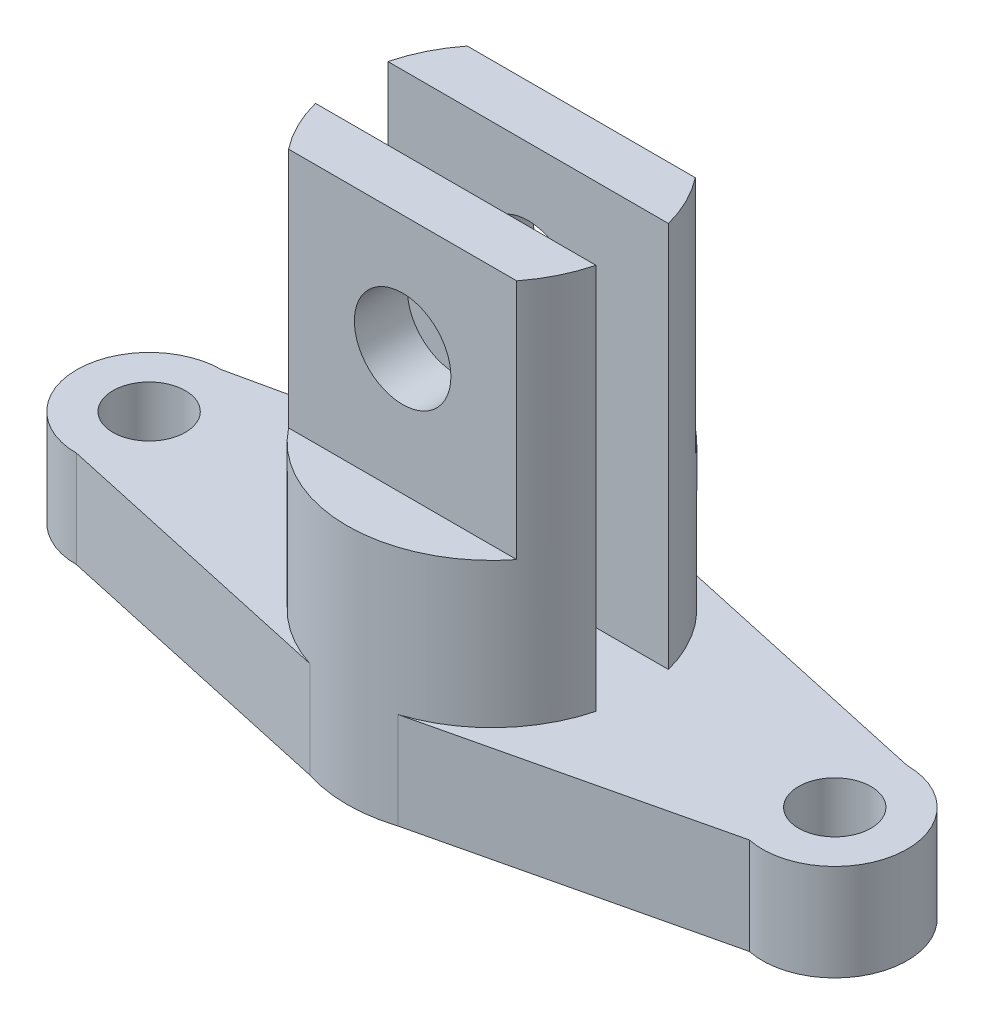
ISO-10303-21;
HEADER;
FILE_DESCRIPTION(('STEP AP214'),'2;1');
FILE_NAME('part.step','',(''),(''),'','','');
FILE_SCHEMA(('AUTOMOTIVE_DESIGN { 1 0 10303 214 1 1 1 1 }'));
ENDSEC;
DATA;
#1=APPLICATION_CONTEXT('core data for automotive mechanical design processes');
#2=APPLICATION_PROTOCOL_DEFINITION('international standard','automotive_design',2000,#1);
#3=PRODUCT_CONTEXT('',#1,'mechanical');
#4=PRODUCT('Part','Part','',(#3));
#5=PRODUCT_RELATED_PRODUCT_CATEGORY('part','',(#4));
#6=PRODUCT_DEFINITION_FORMATION('','',#4);
#7=PRODUCT_DEFINITION_CONTEXT('part definition',#1,'design');
#8=PRODUCT_DEFINITION('design','',#6,#7);
#9=PRODUCT_DEFINITION_SHAPE('','',#8);
#10=(LENGTH_UNIT() NAMED_UNIT(*) SI_UNIT(.MILLI.,.METRE.));
#11=(NAMED_UNIT(*) PLANE_ANGLE_UNIT() SI_UNIT($,.RADIAN.));
#12=(NAMED_UNIT(*) SI_UNIT($,.STERADIAN.) SOLID_ANGLE_UNIT());
#13=UNCERTAINTY_MEASURE_WITH_UNIT(LENGTH_MEASURE(1.E-05),#10,'distance_accuracy_value','');
#14=(GEOMETRIC_REPRESENTATION_CONTEXT(3) GLOBAL_UNCERTAINTY_ASSIGNED_CONTEXT((#13)) GLOBAL_UNIT_ASSIGNED_CONTEXT((#10,
#11,#12)) REPRESENTATION_CONTEXT('',''));
#15=CARTESIAN_POINT('',(0.,0.,0.));
#16=DIRECTION('',(0.,0.,1.));
#17=DIRECTION('',(1.,0.,0.));
#18=AXIS2_PLACEMENT_3D('',#15,#16,#17);
#19=CARTESIAN_POINT('',(21.1399812312886,20.,8.43496558117299));
#20=DIRECTION('',(0.,-1.,0.));
#21=DIRECTION('',(0.,0.,-1.));
#22=AXIS2_PLACEMENT_3D('',#19,#20,#21);
#23=CYLINDRICAL_SURFACE('',#22,30.);
#24=DIRECTION('',(0.,1.,0.));
#25=VECTOR('',#24,1.);
#26=CARTESIAN_POINT('',(-2.47675012595048,50.,26.934965581173));
#27=LINE('',#26,#25);
#28=CARTESIAN_POINT('',(-2.47675012595048,50.,26.934965581173));
#29=VERTEX_POINT('',#28);
#30=CARTESIAN_POINT('',(-2.47675012595048,100.,26.934965581173));
#31=VERTEX_POINT('',#30);
#32=EDGE_CURVE('E171',#29,#31,#27,.T.);
#33=ORIENTED_EDGE('',*,*,#32,.T.);
#34=CARTESIAN_POINT('',(21.1399812312886,100.,8.43496558117299));
#35=DIRECTION('',(0.,1.,0.));
#36=DIRECTION('',(0.,0.,1.));
#37=AXIS2_PLACEMENT_3D('',#34,#35,#36);
#38=CIRCLE('',#37,30.);
#39=CARTESIAN_POINT('',(-7.90739386526701,100.,15.934965581173));
#40=VERTEX_POINT('',#39);
#41=EDGE_CURVE('E181',#40,#31,#38,.T.);
#42=ORIENTED_EDGE('',*,*,#41,.F.);
#43=DIRECTION('',(0.,-1.,0.));
#44=VECTOR('',#43,1.);
#45=CARTESIAN_POINT('',(-7.90739386526701,100.,15.934965581173));
#46=LINE('',#45,#44);
#47=CARTESIAN_POINT('',(-7.90739386526701,20.,15.934965581173));
#48=VERTEX_POINT('',#47);
#49=EDGE_CURVE('E186',#40,#48,#46,.T.);
#50=ORIENTED_EDGE('',*,*,#49,.T.);
#51=CARTESIAN_POINT('',(21.1399812312886,20.,8.43496558117299));
#52=DIRECTION('',(0.,1.,0.));
#53=DIRECTION('',(0.,0.,1.));
#54=AXIS2_PLACEMENT_3D('',#51,#52,#53);
#55=CIRCLE('',#54,30.);
#56=CARTESIAN_POINT('',(11.9859811975325,20.,37.0042547459736));
#57=VERTEX_POINT('',#56);
#58=EDGE_CURVE('E192',#57,#48,#55,.F.);
#59=ORIENTED_EDGE('',*,*,#58,.F.);
#60=DIRECTION('',(0.,-1.,0.));
#61=VECTOR('',#60,1.);
#62=CARTESIAN_POINT('',(11.9859811975326,20.,37.0042547459736));
#63=LINE('',#62,#61);
#64=CARTESIAN_POINT('',(11.9859811975326,0.,37.0042547459736));
#65=VERTEX_POINT('',#64);
#66=EDGE_CURVE('E242',#57,#65,#63,.T.);
#67=ORIENTED_EDGE('',*,*,#66,.T.);
#68=CARTESIAN_POINT('',(21.1399812312886,0.,8.43496558117299));
#69=DIRECTION('',(0.,1.,0.));
#70=DIRECTION('',(0.,0.,1.));
#71=AXIS2_PLACEMENT_3D('',#68,#69,#70);
#72=CIRCLE('',#71,30.);
#73=CARTESIAN_POINT('',(30.2939812650446,0.,37.0042547459736));
#74=VERTEX_POINT('',#73);
#75=EDGE_CURVE('E224',#65,#74,#72,.T.);
#76=ORIENTED_EDGE('',*,*,#75,.T.);
#77=DIRECTION('',(0.,-1.,0.));
#78=VECTOR('',#77,1.);
#79=CARTESIAN_POINT('',(30.2939812650446,20.,37.0042547459736));
#80=LINE('',#79,#78);
#81=CARTESIAN_POINT('',(30.2939812650446,20.,37.0042547459736));
#82=VERTEX_POINT('',#81);
#83=EDGE_CURVE('E11',#82,#74,#80,.T.);
#84=ORIENTED_EDGE('',*,*,#83,.F.);
#85=CARTESIAN_POINT('',(50.1873563278442,20.,15.934965581173));
#86=VERTEX_POINT('',#85);
#87=EDGE_CURVE('E191',#86,#82,#55,.F.);
#88=ORIENTED_EDGE('',*,*,#87,.F.);
#89=DIRECTION('',(0.,-1.,0.));
#90=VECTOR('',#89,1.);
#91=CARTESIAN_POINT('',(50.1873563278442,100.,15.934965581173));
#92=LINE('',#91,#90);
#93=CARTESIAN_POINT('',(50.1873563278442,100.,15.934965581173));
#94=VERTEX_POINT('',#93);
#95=EDGE_CURVE('E189',#94,#86,#92,.T.);
#96=ORIENTED_EDGE('',*,*,#95,.F.);
#97=CARTESIAN_POINT('',(44.7567125885277,100.,26.934965581173));
#98=VERTEX_POINT('',#97);
#99=EDGE_CURVE('E165',#98,#94,#38,.T.);
#100=ORIENTED_EDGE('',*,*,#99,.F.);
#101=DIRECTION('',(0.,1.,0.));
#102=VECTOR('',#101,1.);
#103=CARTESIAN_POINT('',(44.7567125885277,50.,26.934965581173));
#104=LINE('',#103,#102);
#105=CARTESIAN_POINT('',(44.7567125885277,50.,26.934965581173));
#106=VERTEX_POINT('',#105);
#107=EDGE_CURVE('E59',#106,#98,#104,.T.);
#108=ORIENTED_EDGE('',*,*,#107,.F.);
#109=CARTESIAN_POINT('',(21.1399812312886,50.,8.43496558117299));
#110=DIRECTION('',(0.,1.,0.));
#111=DIRECTION('',(0.,0.,1.));
#112=AXIS2_PLACEMENT_3D('',#109,#110,#111);
#113=CIRCLE('',#112,30.);
#114=EDGE_CURVE('E177',#29,#106,#113,.T.);
#115=ORIENTED_EDGE('',*,*,#114,.F.);
#116=EDGE_LOOP('',(#33,#42,#50,#59,#67,#76,#84,#88,#96,#100,#108,#115));
#117=FACE_BOUND('',#116,.T.);
#118=ADVANCED_FACE('F36',(#117),#23,.T.);
#119=CARTESIAN_POINT('',(21.1399812312886,20.,8.43496558117299));
#120=DIRECTION('',(0.,-1.,0.));
#121=DIRECTION('',(0.,0.,-1.));
#122=AXIS2_PLACEMENT_3D('',#119,#120,#121);
#123=CYLINDRICAL_SURFACE('',#122,30.);
#124=DIRECTION('',(0.,1.,0.));
#125=VECTOR('',#124,1.);
#126=CARTESIAN_POINT('',(44.7567125885277,50.,-10.065034418827));
#127=LINE('',#126,#125);
#128=CARTESIAN_POINT('',(44.7567125885277,50.,-10.065034418827));
#129=VERTEX_POINT('',#128);
#130=CARTESIAN_POINT('',(44.7567125885277,100.,-10.065034418827));
#131=VERTEX_POINT('',#130);
#132=EDGE_CURVE('E151',#129,#131,#127,.T.);
#133=ORIENTED_EDGE('',*,*,#132,.T.);
#134=CARTESIAN_POINT('',(21.1399812312886,100.,8.43496558117299));
#135=DIRECTION('',(0.,1.,0.));
#136=DIRECTION('',(0.,0.,1.));
#137=AXIS2_PLACEMENT_3D('',#134,#135,#136);
#138=CIRCLE('',#137,30.);
#139=CARTESIAN_POINT('',(50.1873563278442,100.,0.934965581172988));
#140=VERTEX_POINT('',#139);
#141=EDGE_CURVE('E198',#140,#131,#138,.T.);
#142=ORIENTED_EDGE('',*,*,#141,.F.);
#143=DIRECTION('',(0.,-1.,0.));
#144=VECTOR('',#143,1.);
#145=CARTESIAN_POINT('',(50.1873563278442,100.,0.934965581172988));
#146=LINE('',#145,#144);
#147=CARTESIAN_POINT('',(50.1873563278442,20.,0.934965581172988));
#148=VERTEX_POINT('',#147);
#149=EDGE_CURVE('E203',#140,#148,#146,.T.);
#150=ORIENTED_EDGE('',*,*,#149,.T.);
#151=CARTESIAN_POINT('',(21.1399812312886,20.,8.43496558117299));
#152=DIRECTION('',(0.,1.,0.));
#153=DIRECTION('',(0.,0.,1.));
#154=AXIS2_PLACEMENT_3D('',#151,#152,#153);
#155=CIRCLE('',#154,30.);
#156=CARTESIAN_POINT('',(30.2939812650446,20.,-20.1343235836277));
#157=VERTEX_POINT('',#156);
#158=EDGE_CURVE('E208',#157,#148,#155,.F.);
#159=ORIENTED_EDGE('',*,*,#158,.F.);
#160=DIRECTION('',(0.,-1.,0.));
#161=VECTOR('',#160,1.);
#162=CARTESIAN_POINT('',(30.2939812650446,20.,-20.1343235836277));
#163=LINE('',#162,#161);
#164=CARTESIAN_POINT('',(30.2939812650446,0.,-20.1343235836277));
#165=VERTEX_POINT('',#164);
#166=EDGE_CURVE('E269',#157,#165,#163,.T.);
#167=ORIENTED_EDGE('',*,*,#166,.T.);
#168=CARTESIAN_POINT('',(21.1399812312886,0.,8.43496558117299));
#169=DIRECTION('',(0.,1.,0.));
#170=DIRECTION('',(0.,0.,1.));
#171=AXIS2_PLACEMENT_3D('',#168,#169,#170);
#172=CIRCLE('',#171,30.);
#173=CARTESIAN_POINT('',(11.9859811975326,0.,-20.1343235836276));
#174=VERTEX_POINT('',#173);
#175=EDGE_CURVE('E251',#165,#174,#172,.T.);
#176=ORIENTED_EDGE('',*,*,#175,.T.);
#177=DIRECTION('',(0.,-1.,0.));
#178=VECTOR('',#177,1.);
#179=CARTESIAN_POINT('',(11.9859811975326,20.,-20.1343235836276));
#180=LINE('',#179,#178);
#181=CARTESIAN_POINT('',(11.9859811975325,20.,-20.1343235836276));
#182=VERTEX_POINT('',#181);
#183=EDGE_CURVE('E266',#182,#174,#180,.T.);
#184=ORIENTED_EDGE('',*,*,#183,.F.);
#185=CARTESIAN_POINT('',(-7.90739386526701,20.,0.934965581172988));
#186=VERTEX_POINT('',#185);
#187=EDGE_CURVE('E209',#186,#182,#155,.F.);
#188=ORIENTED_EDGE('',*,*,#187,.F.);
#189=DIRECTION('',(0.,-1.,0.));
#190=VECTOR('',#189,1.);
#191=CARTESIAN_POINT('',(-7.90739386526701,100.,0.934965581172988));
#192=LINE('',#191,#190);
#193=CARTESIAN_POINT('',(-7.90739386526701,100.,0.934965581172988));
#194=VERTEX_POINT('',#193);
#195=EDGE_CURVE('E206',#194,#186,#192,.T.);
#196=ORIENTED_EDGE('',*,*,#195,.F.);
#197=CARTESIAN_POINT('',(-2.47675012595048,100.,-10.065034418827));
#198=VERTEX_POINT('',#197);
#199=EDGE_CURVE('E163',#198,#194,#138,.T.);
#200=ORIENTED_EDGE('',*,*,#199,.F.);
#201=DIRECTION('',(0.,1.,0.));
#202=VECTOR('',#201,1.);
#203=CARTESIAN_POINT('',(-2.47675012595048,50.,-10.065034418827));
#204=LINE('',#203,#202);
#205=CARTESIAN_POINT('',(-2.47675012595048,50.,-10.065034418827));
#206=VERTEX_POINT('',#205);
#207=EDGE_CURVE('E51',#206,#198,#204,.T.);
#208=ORIENTED_EDGE('',*,*,#207,.F.);
#209=CARTESIAN_POINT('',(21.1399812312886,50.,8.43496558117299));
#210=DIRECTION('',(0.,1.,0.));
#211=DIRECTION('',(0.,0.,1.));
#212=AXIS2_PLACEMENT_3D('',#209,#210,#211);
#213=CIRCLE('',#212,30.);
#214=EDGE_CURVE('E154',#129,#206,#213,.T.);
#215=ORIENTED_EDGE('',*,*,#214,.F.);
#216=EDGE_LOOP('',(#133,#142,#150,#159,#167,#176,#184,#188,#196,#200,#208,#215));
#217=FACE_BOUND('',#216,.T.);
#218=ADVANCED_FACE('F161',(#217),#123,.T.);
#219=CARTESIAN_POINT('',(21.1399812312886,100.,8.43496558117299));
#220=DIRECTION('',(0.,1.,0.));
#221=DIRECTION('',(0.,0.,1.));
#222=AXIS2_PLACEMENT_3D('',#219,#220,#221);
#223=PLANE('',#222);
#224=ORIENTED_EDGE('',*,*,#141,.T.);
#225=DIRECTION('',(-1.,0.,0.));
#226=VECTOR('',#225,1.);
#227=CARTESIAN_POINT('',(44.7567125885277,100.,-10.065034418827));
#228=LINE('',#227,#226);
#229=EDGE_CURVE('E158',#131,#198,#228,.T.);
#230=ORIENTED_EDGE('',*,*,#229,.T.);
#231=ORIENTED_EDGE('',*,*,#199,.T.);
#232=DIRECTION('',(1.,0.,0.));
#233=VECTOR('',#232,1.);
#234=CARTESIAN_POINT('',(-7.90739386526701,100.,0.934965581172988));
#235=LINE('',#234,#233);
#236=EDGE_CURVE('E201',#194,#140,#235,.T.);
#237=ORIENTED_EDGE('',*,*,#236,.T.);
#238=EDGE_LOOP('',(#224,#230,#231,#237));
#239=FACE_BOUND('',#238,.T.);
#240=ADVANCED_FACE('F325',(#239),#223,.T.);
#241=CARTESIAN_POINT('',(21.1399812312886,100.,8.43496558117299));
#242=DIRECTION('',(0.,1.,0.));
#243=DIRECTION('',(0.,0.,1.));
#244=AXIS2_PLACEMENT_3D('',#241,#242,#243);
#245=PLANE('',#244);
#246=ORIENTED_EDGE('',*,*,#41,.T.);
#247=DIRECTION('',(1.,0.,0.));
#248=VECTOR('',#247,1.);
#249=CARTESIAN_POINT('',(-2.47675012595048,100.,26.934965581173));
#250=LINE('',#249,#248);
#251=EDGE_CURVE('E175',#31,#98,#250,.T.);
#252=ORIENTED_EDGE('',*,*,#251,.T.);
#253=ORIENTED_EDGE('',*,*,#99,.T.);
#254=DIRECTION('',(-1.,0.,0.));
#255=VECTOR('',#254,1.);
#256=CARTESIAN_POINT('',(50.1873563278442,100.,15.934965581173));
#257=LINE('',#256,#255);
#258=EDGE_CURVE('E184',#94,#40,#257,.T.);
#259=ORIENTED_EDGE('',*,*,#258,.T.);
#260=EDGE_LOOP('',(#246,#252,#253,#259));
#261=FACE_BOUND('',#260,.T.);
#262=ADVANCED_FACE('F370',(#261),#245,.T.);
#263=CARTESIAN_POINT('',(21.1399812312886,20.,8.43496558117299));
#264=DIRECTION('',(0.,1.,0.));
#265=DIRECTION('',(0.,0.,1.));
#266=AXIS2_PLACEMENT_3D('',#263,#264,#265);
#267=PLANE('',#266);
#268=CARTESIAN_POINT('',(-49.8600187687114,20.,8.43496558117299));
#269=DIRECTION('',(0.,1.,0.));
#270=DIRECTION('',(0.,0.,1.));
#271=AXIS2_PLACEMENT_3D('',#268,#269,#270);
#272=CIRCLE('',#271,7.5);
#273=CARTESIAN_POINT('',(-49.8600187687114,20.,15.934965581173));
#274=VERTEX_POINT('',#273);
#275=EDGE_CURVE('E221',#274,#274,#272,.T.);
#276=ORIENTED_EDGE('',*,*,#275,.F.);
#277=EDGE_LOOP('',(#276));
#278=FACE_BOUND('',#277,.T.);
#279=CARTESIAN_POINT('',(92.1399812312886,20.,8.43496558117299));
#280=DIRECTION('',(0.,1.,0.));
#281=DIRECTION('',(0.,0.,1.));
#282=AXIS2_PLACEMENT_3D('',#279,#280,#281);
#283=CIRCLE('',#282,7.50000000000001);
#284=CARTESIAN_POINT('',(92.1399812312886,20.,15.934965581173));
#285=VERTEX_POINT('',#284);
#286=EDGE_CURVE('E215',#285,#285,#283,.T.);
#287=ORIENTED_EDGE('',*,*,#286,.F.);
#288=EDGE_LOOP('',(#287));
#289=FACE_BOUND('',#288,.T.);
#290=DIRECTION('',(0.9767663727197,0.,0.214306913383585));
#291=VECTOR('',#290,1.);
#292=CARTESIAN_POINT('',(-49.8600187687114,20.,23.434965581173));
#293=LINE('',#292,#291);
#294=CARTESIAN_POINT('',(-49.8600187687114,20.,23.434965581173));
#295=VERTEX_POINT('',#294);
#296=EDGE_CURVE('E239',#295,#57,#293,.T.);
#297=ORIENTED_EDGE('',*,*,#296,.T.);
#298=ORIENTED_EDGE('',*,*,#58,.T.);
#299=DIRECTION('',(1.,0.,0.));
#300=VECTOR('',#299,1.);
#301=CARTESIAN_POINT('',(21.1399812312886,20.,15.934965581173));
#302=LINE('',#301,#300);
#303=EDGE_CURVE('E195',#48,#86,#302,.T.);
#304=ORIENTED_EDGE('',*,*,#303,.T.);
#305=ORIENTED_EDGE('',*,*,#87,.T.);
#306=DIRECTION('',(0.973306019106119,0.,-0.229511204893791));
#307=VECTOR('',#306,1.);
#308=CARTESIAN_POINT('',(89.131173768969,20.,23.1301034728258));
#309=LINE('',#308,#307);
#310=CARTESIAN_POINT('',(89.131173768969,20.,23.1301034728258));
#311=VERTEX_POINT('',#310);
#312=EDGE_CURVE('E227',#82,#311,#309,.T.);
#313=ORIENTED_EDGE('',*,*,#312,.T.);
#314=CARTESIAN_POINT('',(92.1399812312886,20.,8.43496558117299));
#315=DIRECTION('',(0.,1.,0.));
#316=DIRECTION('',(0.,0.,1.));
#317=AXIS2_PLACEMENT_3D('',#314,#315,#316);
#318=CIRCLE('',#317,15.);
#319=CARTESIAN_POINT('',(92.1399812312886,20.,-6.56503441882701));
#320=VERTEX_POINT('',#319);
#321=EDGE_CURVE('E229',#311,#320,#318,.T.);
#322=ORIENTED_EDGE('',*,*,#321,.T.);
#323=DIRECTION('',(-0.9767663727197,0.,-0.214306913383585));
#324=VECTOR('',#323,1.);
#325=CARTESIAN_POINT('',(92.1399812312886,20.,-6.56503441882701));
#326=LINE('',#325,#324);
#327=EDGE_CURVE('E232',#320,#157,#326,.T.);
#328=ORIENTED_EDGE('',*,*,#327,.T.);
#329=ORIENTED_EDGE('',*,*,#158,.T.);
#330=DIRECTION('',(-1.,0.,0.));
#331=VECTOR('',#330,1.);
#332=CARTESIAN_POINT('',(21.1399812312886,20.,0.934965581172988));
#333=LINE('',#332,#331);
#334=EDGE_CURVE('E211',#148,#186,#333,.T.);
#335=ORIENTED_EDGE('',*,*,#334,.T.);
#336=ORIENTED_EDGE('',*,*,#187,.T.);
#337=DIRECTION('',(-0.9767663727197,0.,0.214306913383585));
#338=VECTOR('',#337,1.);
#339=CARTESIAN_POINT('',(-49.8600187687114,20.,-6.56503441882701));
#340=LINE('',#339,#338);
#341=CARTESIAN_POINT('',(-49.8600187687114,20.,-6.56503441882701));
#342=VERTEX_POINT('',#341);
#343=EDGE_CURVE('E235',#182,#342,#340,.T.);
#344=ORIENTED_EDGE('',*,*,#343,.T.);
#345=CARTESIAN_POINT('',(-49.8600187687114,20.,8.43496558117299));
#346=DIRECTION('',(0.,1.,0.));
#347=DIRECTION('',(0.,0.,1.));
#348=AXIS2_PLACEMENT_3D('',#345,#346,#347);
#349=CIRCLE('',#348,15.);
#350=EDGE_CURVE('E237',#342,#295,#349,.T.);
#351=ORIENTED_EDGE('',*,*,#350,.T.);
#352=EDGE_LOOP('',(#297,#298,#304,#305,#313,#322,#328,#329,#335,#336,#344,#351));
#353=FACE_BOUND('',#352,.T.);
#354=ADVANCED_FACE('F300',(#278,#289,#353),#267,.T.);
#355=CARTESIAN_POINT('',(21.1399812312886,0.,8.43496558117299));
#356=DIRECTION('',(0.,1.,0.));
#357=DIRECTION('',(0.,0.,1.));
#358=AXIS2_PLACEMENT_3D('',#355,#356,#357);
#359=PLANE('',#358);
#360=DIRECTION('',(0.973306019106119,0.,-0.229511204893791));
#361=VECTOR('',#360,1.);
#362=CARTESIAN_POINT('',(89.131173768969,0.,23.1301034728258));
#363=LINE('',#362,#361);
#364=CARTESIAN_POINT('',(89.131173768969,0.,23.1301034728258));
#365=VERTEX_POINT('',#364);
#366=EDGE_CURVE('E245',#74,#365,#363,.T.);
#367=ORIENTED_EDGE('',*,*,#366,.F.);
#368=ORIENTED_EDGE('',*,*,#75,.F.);
#369=DIRECTION('',(0.9767663727197,0.,0.214306913383585));
#370=VECTOR('',#369,1.);
#371=CARTESIAN_POINT('',(-49.8600187687114,0.,23.434965581173));
#372=LINE('',#371,#370);
#373=CARTESIAN_POINT('',(-49.8600187687114,0.,23.434965581173));
#374=VERTEX_POINT('',#373);
#375=EDGE_CURVE('E230',#374,#65,#372,.T.);
#376=ORIENTED_EDGE('',*,*,#375,.F.);
#377=CARTESIAN_POINT('',(-49.8600187687114,0.,8.43496558117299));
#378=DIRECTION('',(0.,1.,0.));
#379=DIRECTION('',(0.,0.,1.));
#380=AXIS2_PLACEMENT_3D('',#377,#378,#379);
#381=CIRCLE('',#380,15.);
#382=CARTESIAN_POINT('',(-49.8600187687114,0.,-6.56503441882701));
#383=VERTEX_POINT('',#382);
#384=EDGE_CURVE('E255',#383,#374,#381,.T.);
#385=ORIENTED_EDGE('',*,*,#384,.F.);
#386=DIRECTION('',(-0.9767663727197,0.,0.214306913383585));
#387=VECTOR('',#386,1.);
#388=CARTESIAN_POINT('',(-49.8600187687114,0.,-6.56503441882701));
#389=LINE('',#388,#387);
#390=EDGE_CURVE('E253',#174,#383,#389,.T.);
#391=ORIENTED_EDGE('',*,*,#390,.F.);
#392=ORIENTED_EDGE('',*,*,#175,.F.);
#393=DIRECTION('',(-0.9767663727197,0.,-0.214306913383585));
#394=VECTOR('',#393,1.);
#395=CARTESIAN_POINT('',(92.1399812312886,0.,-6.56503441882701));
#396=LINE('',#395,#394);
#397=CARTESIAN_POINT('',(92.1399812312886,0.,-6.56503441882701));
#398=VERTEX_POINT('',#397);
#399=EDGE_CURVE('E249',#398,#165,#396,.T.);
#400=ORIENTED_EDGE('',*,*,#399,.F.);
#401=CARTESIAN_POINT('',(92.1399812312886,0.,8.43496558117299));
#402=DIRECTION('',(0.,1.,0.));
#403=DIRECTION('',(0.,0.,1.));
#404=AXIS2_PLACEMENT_3D('',#401,#402,#403);
#405=CIRCLE('',#404,15.);
#406=EDGE_CURVE('E247',#365,#398,#405,.T.);
#407=ORIENTED_EDGE('',*,*,#406,.F.);
#408=EDGE_LOOP('',(#367,#368,#376,#385,#391,#392,#400,#407));
#409=FACE_BOUND('',#408,.T.);
#410=CARTESIAN_POINT('',(-49.8600187687114,0.,8.43496558117299));
#411=DIRECTION('',(0.,1.,0.));
#412=DIRECTION('',(0.,0.,1.));
#413=AXIS2_PLACEMENT_3D('',#410,#411,#412);
#414=CIRCLE('',#413,7.5);
#415=CARTESIAN_POINT('',(-49.8600187687114,0.,15.934965581173));
#416=VERTEX_POINT('',#415);
#417=EDGE_CURVE('E218',#416,#416,#414,.T.);
#418=ORIENTED_EDGE('',*,*,#417,.T.);
#419=EDGE_LOOP('',(#418));
#420=FACE_BOUND('',#419,.T.);
#421=CARTESIAN_POINT('',(92.1399812312886,0.,8.43496558117299));
#422=DIRECTION('',(0.,1.,0.));
#423=DIRECTION('',(0.,0.,1.));
#424=AXIS2_PLACEMENT_3D('',#421,#422,#423);
#425=CIRCLE('',#424,7.50000000000001);
#426=CARTESIAN_POINT('',(92.1399812312886,0.,15.934965581173));
#427=VERTEX_POINT('',#426);
#428=EDGE_CURVE('E214',#427,#427,#425,.T.);
#429=ORIENTED_EDGE('',*,*,#428,.T.);
#430=EDGE_LOOP('',(#429));
#431=FACE_BOUND('',#430,.T.);
#432=ADVANCED_FACE('F286',(#409,#420,#431),#359,.F.);
#433=CARTESIAN_POINT('',(89.131173768969,20.,23.1301034728258));
#434=DIRECTION('',(-0.229511204893791,0.,-0.973306019106119));
#435=DIRECTION('',(-0.973306019106119,0.,0.229511204893791));
#436=AXIS2_PLACEMENT_3D('',#433,#434,#435);
#437=PLANE('',#436);
#438=ORIENTED_EDGE('',*,*,#366,.T.);
#439=DIRECTION('',(0.,-1.,0.));
#440=VECTOR('',#439,1.);
#441=CARTESIAN_POINT('',(89.131173768969,20.,23.1301034728258));
#442=LINE('',#441,#440);
#443=EDGE_CURVE('E44',#311,#365,#442,.T.);
#444=ORIENTED_EDGE('',*,*,#443,.F.);
#445=ORIENTED_EDGE('',*,*,#312,.F.);
#446=ORIENTED_EDGE('',*,*,#83,.T.);
#447=EDGE_LOOP('',(#438,#444,#445,#446));
#448=FACE_BOUND('',#447,.T.);
#449=ADVANCED_FACE('F303',(#448),#437,.F.);
#450=CARTESIAN_POINT('',(92.1399812312886,20.,8.43496558117299));
#451=DIRECTION('',(0.,-1.,0.));
#452=DIRECTION('',(0.,0.,-1.));
#453=AXIS2_PLACEMENT_3D('',#450,#451,#452);
#454=CYLINDRICAL_SURFACE('',#453,15.);
#455=ORIENTED_EDGE('',*,*,#406,.T.);
#456=DIRECTION('',(0.,-1.,0.));
#457=VECTOR('',#456,1.);
#458=CARTESIAN_POINT('',(92.1399812312886,20.,-6.56503441882701));
#459=LINE('',#458,#457);
#460=EDGE_CURVE('E272',#320,#398,#459,.T.);
#461=ORIENTED_EDGE('',*,*,#460,.F.);
#462=ORIENTED_EDGE('',*,*,#321,.F.);
#463=ORIENTED_EDGE('',*,*,#443,.T.);
#464=EDGE_LOOP('',(#455,#461,#462,#463));
#465=FACE_BOUND('',#464,.T.);
#466=ADVANCED_FACE('F280',(#465),#454,.T.);
#467=CARTESIAN_POINT('',(92.1399812312886,20.,-6.56503441882701));
#468=DIRECTION('',(-0.214306913383585,0.,0.9767663727197));
#469=DIRECTION('',(0.9767663727197,0.,0.214306913383585));
#470=AXIS2_PLACEMENT_3D('',#467,#468,#469);
#471=PLANE('',#470);
#472=ORIENTED_EDGE('',*,*,#399,.T.);
#473=ORIENTED_EDGE('',*,*,#166,.F.);
#474=ORIENTED_EDGE('',*,*,#327,.F.);
#475=ORIENTED_EDGE('',*,*,#460,.T.);
#476=EDGE_LOOP('',(#472,#473,#474,#475));
#477=FACE_BOUND('',#476,.T.);
#478=ADVANCED_FACE('F293',(#477),#471,.F.);
#479=CARTESIAN_POINT('',(-49.8600187687114,20.,-6.56503441882701));
#480=DIRECTION('',(0.214306913383585,0.,0.9767663727197));
#481=DIRECTION('',(0.9767663727197,0.,-0.214306913383585));
#482=AXIS2_PLACEMENT_3D('',#479,#480,#481);
#483=PLANE('',#482);
#484=ORIENTED_EDGE('',*,*,#390,.T.);
#485=DIRECTION('',(0.,-1.,0.));
#486=VECTOR('',#485,1.);
#487=CARTESIAN_POINT('',(-49.8600187687114,20.,-6.56503441882701));
#488=LINE('',#487,#486);
#489=EDGE_CURVE('E263',#342,#383,#488,.T.);
#490=ORIENTED_EDGE('',*,*,#489,.F.);
#491=ORIENTED_EDGE('',*,*,#343,.F.);
#492=ORIENTED_EDGE('',*,*,#183,.T.);
#493=EDGE_LOOP('',(#484,#490,#491,#492));
#494=FACE_BOUND('',#493,.T.);
#495=ADVANCED_FACE('F319',(#494),#483,.F.);
#496=CARTESIAN_POINT('',(-49.8600187687114,20.,8.43496558117299));
#497=DIRECTION('',(0.,-1.,0.));
#498=DIRECTION('',(0.,0.,-1.));
#499=AXIS2_PLACEMENT_3D('',#496,#497,#498);
#500=CYLINDRICAL_SURFACE('',#499,15.);
#501=ORIENTED_EDGE('',*,*,#384,.T.);
#502=DIRECTION('',(0.,-1.,0.));
#503=VECTOR('',#502,1.);
#504=CARTESIAN_POINT('',(-49.8600187687114,20.,23.434965581173));
#505=LINE('',#504,#503);
#506=EDGE_CURVE('E260',#295,#374,#505,.T.);
#507=ORIENTED_EDGE('',*,*,#506,.F.);
#508=ORIENTED_EDGE('',*,*,#350,.F.);
#509=ORIENTED_EDGE('',*,*,#489,.T.);
#510=EDGE_LOOP('',(#501,#507,#508,#509));
#511=FACE_BOUND('',#510,.T.);
#512=ADVANCED_FACE('F315',(#511),#500,.T.);
#513=CARTESIAN_POINT('',(-49.8600187687114,20.,23.434965581173));
#514=DIRECTION('',(0.214306913383585,0.,-0.9767663727197));
#515=DIRECTION('',(-0.9767663727197,0.,-0.214306913383585));
#516=AXIS2_PLACEMENT_3D('',#513,#514,#515);
#517=PLANE('',#516);
#518=ORIENTED_EDGE('',*,*,#375,.T.);
#519=ORIENTED_EDGE('',*,*,#66,.F.);
#520=ORIENTED_EDGE('',*,*,#296,.F.);
#521=ORIENTED_EDGE('',*,*,#506,.T.);
#522=EDGE_LOOP('',(#518,#519,#520,#521));
#523=FACE_BOUND('',#522,.T.);
#524=ADVANCED_FACE('F310',(#523),#517,.F.);
#525=CARTESIAN_POINT('',(-49.8600187687114,20.,8.43496558117299));
#526=DIRECTION('',(0.,-1.,0.));
#527=DIRECTION('',(0.,0.,-1.));
#528=AXIS2_PLACEMENT_3D('',#525,#526,#527);
#529=CYLINDRICAL_SURFACE('',#528,7.5);
#530=ORIENTED_EDGE('',*,*,#275,.T.);
#531=EDGE_LOOP('',(#530));
#532=FACE_BOUND('',#531,.T.);
#533=ORIENTED_EDGE('',*,*,#417,.F.);
#534=EDGE_LOOP('',(#533));
#535=FACE_BOUND('',#534,.T.);
#536=ADVANCED_FACE('F358',(#532,#535),#529,.F.);
#537=CARTESIAN_POINT('',(92.1399812312886,20.,8.43496558117299));
#538=DIRECTION('',(0.,-1.,0.));
#539=DIRECTION('',(0.,0.,-1.));
#540=AXIS2_PLACEMENT_3D('',#537,#538,#539);
#541=CYLINDRICAL_SURFACE('',#540,7.50000000000001);
#542=ORIENTED_EDGE('',*,*,#286,.T.);
#543=EDGE_LOOP('',(#542));
#544=FACE_BOUND('',#543,.T.);
#545=ORIENTED_EDGE('',*,*,#428,.F.);
#546=EDGE_LOOP('',(#545));
#547=FACE_BOUND('',#546,.T.);
#548=ADVANCED_FACE('F349',(#544,#547),#541,.F.);
#549=CARTESIAN_POINT('',(-7.90739386526701,100.,0.934965581172988));
#550=DIRECTION('',(0.,0.,-1.));
#551=DIRECTION('',(-1.,0.,0.));
#552=AXIS2_PLACEMENT_3D('',#549,#550,#551);
#553=PLANE('',#552);
#554=CARTESIAN_POINT('',(21.1399812312886,76.,0.934965581172988));
#555=DIRECTION('',(0.,0.,-1.));
#556=DIRECTION('',(-1.,0.,0.));
#557=AXIS2_PLACEMENT_3D('',#554,#555,#556);
#558=CIRCLE('',#557,10.);
#559=CARTESIAN_POINT('',(11.1399812312886,76.,0.934965581172988));
#560=VERTEX_POINT('',#559);
#561=EDGE_CURVE('E174',#560,#560,#558,.F.);
#562=ORIENTED_EDGE('',*,*,#561,.F.);
#563=EDGE_LOOP('',(#562));
#564=FACE_BOUND('',#563,.T.);
#565=ORIENTED_EDGE('',*,*,#334,.F.);
#566=ORIENTED_EDGE('',*,*,#149,.F.);
#567=ORIENTED_EDGE('',*,*,#236,.F.);
#568=ORIENTED_EDGE('',*,*,#195,.T.);
#569=EDGE_LOOP('',(#565,#566,#567,#568));
#570=FACE_BOUND('',#569,.T.);
#571=ADVANCED_FACE('F322',(#564,#570),#553,.F.);
#572=CARTESIAN_POINT('',(50.1873563278442,100.,15.934965581173));
#573=DIRECTION('',(0.,0.,1.));
#574=DIRECTION('',(1.,0.,0.));
#575=AXIS2_PLACEMENT_3D('',#572,#573,#574);
#576=PLANE('',#575);
#577=CARTESIAN_POINT('',(21.1399812312886,76.,15.934965581173));
#578=DIRECTION('',(0.,0.,1.));
#579=DIRECTION('',(1.,0.,0.));
#580=AXIS2_PLACEMENT_3D('',#577,#578,#579);
#581=CIRCLE('',#580,10.);
#582=CARTESIAN_POINT('',(31.1399812312886,76.,15.934965581173));
#583=VERTEX_POINT('',#582);
#584=EDGE_CURVE('E329',#583,#583,#581,.F.);
#585=ORIENTED_EDGE('',*,*,#584,.F.);
#586=EDGE_LOOP('',(#585));
#587=FACE_BOUND('',#586,.T.);
#588=ORIENTED_EDGE('',*,*,#303,.F.);
#589=ORIENTED_EDGE('',*,*,#49,.F.);
#590=ORIENTED_EDGE('',*,*,#258,.F.);
#591=ORIENTED_EDGE('',*,*,#95,.T.);
#592=EDGE_LOOP('',(#588,#589,#590,#591));
#593=FACE_BOUND('',#592,.T.);
#594=ADVANCED_FACE('F348',(#587,#593),#576,.F.);
#595=CARTESIAN_POINT('',(-2.47675012595048,50.,26.934965581173));
#596=DIRECTION('',(0.,0.,1.));
#597=DIRECTION('',(1.,0.,0.));
#598=AXIS2_PLACEMENT_3D('',#595,#596,#597);
#599=PLANE('',#598);
#600=CARTESIAN_POINT('',(21.1399812312886,76.,26.934965581173));
#601=DIRECTION('',(0.,0.,1.));
#602=DIRECTION('',(1.,0.,0.));
#603=AXIS2_PLACEMENT_3D('',#600,#601,#602);
#604=CIRCLE('',#603,10.);
#605=CARTESIAN_POINT('',(31.1399812312886,76.,26.934965581173));
#606=VERTEX_POINT('',#605);
#607=EDGE_CURVE('E332',#606,#606,#604,.F.);
#608=ORIENTED_EDGE('',*,*,#607,.T.);
#609=EDGE_LOOP('',(#608));
#610=FACE_BOUND('',#609,.T.);
#611=ORIENTED_EDGE('',*,*,#251,.F.);
#612=ORIENTED_EDGE('',*,*,#32,.F.);
#613=DIRECTION('',(1.,0.,0.));
#614=VECTOR('',#613,1.);
#615=CARTESIAN_POINT('',(-2.47675012595048,50.,26.934965581173));
#616=LINE('',#615,#614);
#617=EDGE_CURVE('E170',#29,#106,#616,.T.);
#618=ORIENTED_EDGE('',*,*,#617,.T.);
#619=ORIENTED_EDGE('',*,*,#107,.T.);
#620=EDGE_LOOP('',(#611,#612,#618,#619));
#621=FACE_BOUND('',#620,.T.);
#622=ADVANCED_FACE('F355',(#610,#621),#599,.T.);
#623=CARTESIAN_POINT('',(21.1399812312886,50.,8.43496558117299));
#624=DIRECTION('',(0.,1.,0.));
#625=DIRECTION('',(0.,0.,1.));
#626=AXIS2_PLACEMENT_3D('',#623,#624,#625);
#627=PLANE('',#626);
#628=ORIENTED_EDGE('',*,*,#114,.T.);
#629=ORIENTED_EDGE('',*,*,#617,.F.);
#630=EDGE_LOOP('',(#628,#629));
#631=FACE_BOUND('',#630,.T.);
#632=ADVANCED_FACE('F479',(#631),#627,.T.);
#633=CARTESIAN_POINT('',(44.7567125885277,50.,-10.065034418827));
#634=DIRECTION('',(0.,0.,-1.));
#635=DIRECTION('',(-1.,0.,0.));
#636=AXIS2_PLACEMENT_3D('',#633,#634,#635);
#637=PLANE('',#636);
#638=CARTESIAN_POINT('',(21.1399812312886,76.,-10.065034418827));
#639=DIRECTION('',(0.,0.,-1.));
#640=DIRECTION('',(-1.,0.,0.));
#641=AXIS2_PLACEMENT_3D('',#638,#639,#640);
#642=CIRCLE('',#641,10.);
#643=CARTESIAN_POINT('',(11.1399812312886,76.,-10.065034418827));
#644=VERTEX_POINT('',#643);
#645=EDGE_CURVE('E39',#644,#644,#642,.F.);
#646=ORIENTED_EDGE('',*,*,#645,.T.);
#647=EDGE_LOOP('',(#646));
#648=FACE_BOUND('',#647,.T.);
#649=ORIENTED_EDGE('',*,*,#229,.F.);
#650=ORIENTED_EDGE('',*,*,#132,.F.);
#651=DIRECTION('',(-1.,0.,0.));
#652=VECTOR('',#651,1.);
#653=CARTESIAN_POINT('',(44.7567125885277,50.,-10.065034418827));
#654=LINE('',#653,#652);
#655=EDGE_CURVE('E147',#129,#206,#654,.T.);
#656=ORIENTED_EDGE('',*,*,#655,.T.);
#657=ORIENTED_EDGE('',*,*,#207,.T.);
#658=EDGE_LOOP('',(#649,#650,#656,#657));
#659=FACE_BOUND('',#658,.T.);
#660=ADVANCED_FACE('F149',(#648,#659),#637,.T.);
#661=CARTESIAN_POINT('',(21.1399812312886,50.,8.43496558117299));
#662=DIRECTION('',(0.,1.,0.));
#663=DIRECTION('',(0.,0.,1.));
#664=AXIS2_PLACEMENT_3D('',#661,#662,#663);
#665=PLANE('',#664);
#666=ORIENTED_EDGE('',*,*,#214,.T.);
#667=ORIENTED_EDGE('',*,*,#655,.F.);
#668=EDGE_LOOP('',(#666,#667));
#669=FACE_BOUND('',#668,.T.);
#670=ADVANCED_FACE('F156',(#669),#665,.T.);
#671=CARTESIAN_POINT('',(21.1399812312886,76.,56.934965581173));
#672=DIRECTION('',(0.,0.,-1.));
#673=DIRECTION('',(-1.,0.,0.));
#674=AXIS2_PLACEMENT_3D('',#671,#672,#673);
#675=CYLINDRICAL_SURFACE('',#674,10.);
#676=ORIENTED_EDGE('',*,*,#645,.F.);
#677=EDGE_LOOP('',(#676));
#678=FACE_BOUND('',#677,.T.);
#679=ORIENTED_EDGE('',*,*,#561,.T.);
#680=EDGE_LOOP('',(#679));
#681=FACE_BOUND('',#680,.T.);
#682=ADVANCED_FACE('F340',(#678,#681),#675,.F.);
#683=ORIENTED_EDGE('',*,*,#607,.F.);
#684=EDGE_LOOP('',(#683));
#685=FACE_BOUND('',#684,.T.);
#686=ORIENTED_EDGE('',*,*,#584,.T.);
#687=EDGE_LOOP('',(#686));
#688=FACE_BOUND('',#687,.T.);
#689=ADVANCED_FACE('F343',(#685,#688),#675,.F.);
#690=CLOSED_SHELL('',(#118,#218,#240,#262,#354,#432,#449,#466,#478,#495,#512,#524,#536,#548,
#571,#594,#622,#632,#660,#670,#682,#689));
#691=MANIFOLD_SOLID_BREP('B2',#690);
#692=ADVANCED_BREP_SHAPE_REPRESENTATION('',(#18,#691),#14);
#693=SHAPE_DEFINITION_REPRESENTATION(#9,#692);
ENDSEC;
END-ISO-10303-21;
